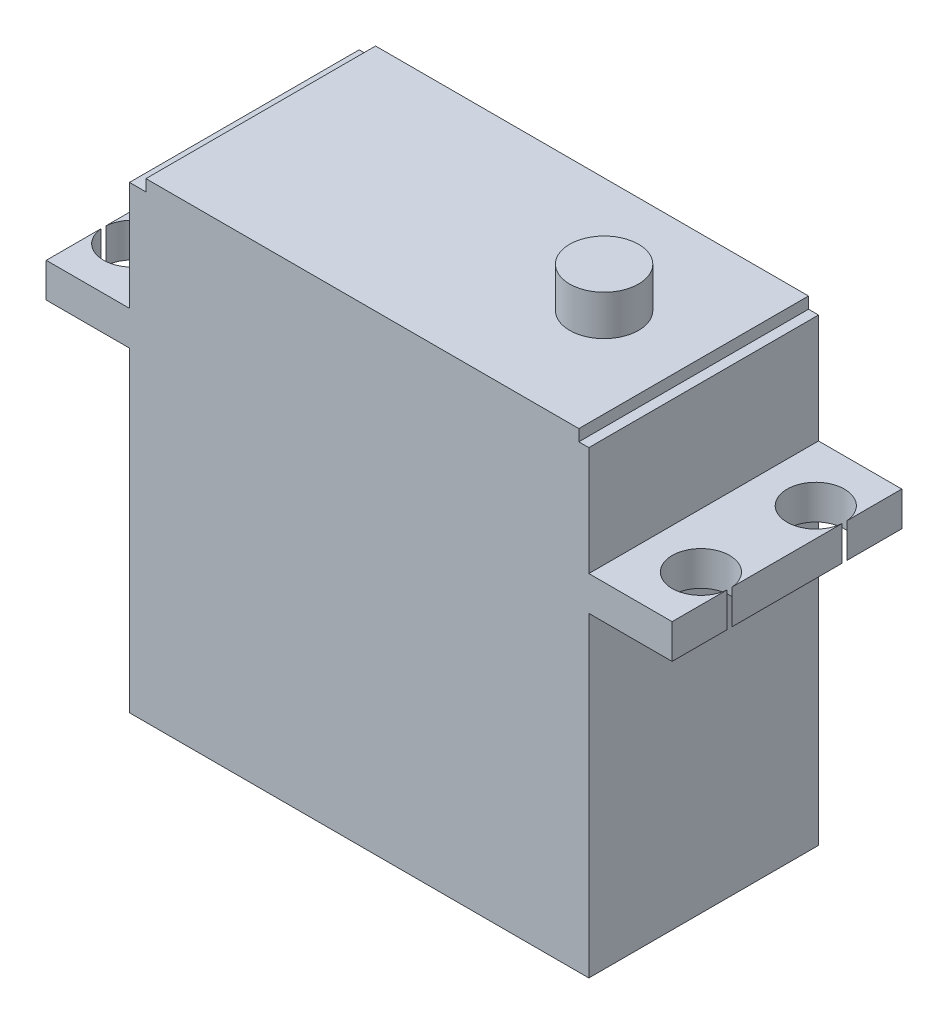
ISO-10303-21;
HEADER;
FILE_DESCRIPTION(('STEP AP214'),'2;1');
FILE_NAME('part.step','',(''),(''),'','','');
FILE_SCHEMA(('AUTOMOTIVE_DESIGN { 1 0 10303 214 1 1 1 1 }'));
ENDSEC;
DATA;
#1=APPLICATION_CONTEXT('core data for automotive mechanical design processes');
#2=APPLICATION_PROTOCOL_DEFINITION('international standard','automotive_design',2000,#1);
#3=PRODUCT_CONTEXT('',#1,'mechanical');
#4=PRODUCT('Part','Part','',(#3));
#5=PRODUCT_RELATED_PRODUCT_CATEGORY('part','',(#4));
#6=PRODUCT_DEFINITION_FORMATION('','',#4);
#7=PRODUCT_DEFINITION_CONTEXT('part definition',#1,'design');
#8=PRODUCT_DEFINITION('design','',#6,#7);
#9=PRODUCT_DEFINITION_SHAPE('','',#8);
#10=(LENGTH_UNIT() NAMED_UNIT(*) SI_UNIT(.MILLI.,.METRE.));
#11=(NAMED_UNIT(*) PLANE_ANGLE_UNIT() SI_UNIT($,.RADIAN.));
#12=(NAMED_UNIT(*) SI_UNIT($,.STERADIAN.) SOLID_ANGLE_UNIT());
#13=UNCERTAINTY_MEASURE_WITH_UNIT(LENGTH_MEASURE(1.E-05),#10,'distance_accuracy_value','');
#14=(GEOMETRIC_REPRESENTATION_CONTEXT(3) GLOBAL_UNCERTAINTY_ASSIGNED_CONTEXT((#13)) GLOBAL_UNIT_ASSIGNED_CONTEXT((#10,
#11,#12)) REPRESENTATION_CONTEXT('',''));
#15=CARTESIAN_POINT('',(0.,0.,0.));
#16=DIRECTION('',(0.,0.,1.));
#17=DIRECTION('',(1.,0.,0.));
#18=AXIS2_PLACEMENT_3D('',#15,#16,#17);
#19=CARTESIAN_POINT('',(-20.,40.,-20.));
#20=DIRECTION('',(0.,1.,0.));
#21=DIRECTION('',(0.,0.,1.));
#22=AXIS2_PLACEMENT_3D('',#19,#20,#21);
#23=PLANE('',#22);
#24=DIRECTION('',(0.,0.,-1.));
#25=VECTOR('',#24,1.);
#26=CARTESIAN_POINT('',(19.1304020421922,40.,0.));
#27=LINE('',#26,#25);
#28=CARTESIAN_POINT('',(19.1304020421922,40.,0.));
#29=VERTEX_POINT('',#28);
#30=CARTESIAN_POINT('',(19.1304020421922,40.,-20.));
#31=VERTEX_POINT('',#30);
#32=EDGE_CURVE('E221',#29,#31,#27,.T.);
#33=ORIENTED_EDGE('',*,*,#32,.F.);
#34=DIRECTION('',(-1.,0.,0.));
#35=VECTOR('',#34,1.);
#36=CARTESIAN_POINT('',(-20.,40.,0.));
#37=LINE('',#36,#35);
#38=CARTESIAN_POINT('',(20.,40.,0.));
#39=VERTEX_POINT('',#38);
#40=EDGE_CURVE('E329',#39,#29,#37,.T.);
#41=ORIENTED_EDGE('',*,*,#40,.F.);
#42=DIRECTION('',(0.,0.,1.));
#43=VECTOR('',#42,1.);
#44=CARTESIAN_POINT('',(20.,40.,-20.));
#45=LINE('',#44,#43);
#46=CARTESIAN_POINT('',(20.,40.,-20.));
#47=VERTEX_POINT('',#46);
#48=EDGE_CURVE('E392',#47,#39,#45,.T.);
#49=ORIENTED_EDGE('',*,*,#48,.F.);
#50=DIRECTION('',(-1.,0.,0.));
#51=VECTOR('',#50,1.);
#52=CARTESIAN_POINT('',(-20.,40.,-20.));
#53=LINE('',#52,#51);
#54=EDGE_CURVE('E63',#47,#31,#53,.T.);
#55=ORIENTED_EDGE('',*,*,#54,.T.);
#56=EDGE_LOOP('',(#33,#41,#49,#55));
#57=FACE_BOUND('',#56,.T.);
#58=ADVANCED_FACE('F39',(#57),#23,.T.);
#59=CARTESIAN_POINT('',(-27.25,27.5,-20.));
#60=DIRECTION('',(-1.,0.,0.));
#61=DIRECTION('',(0.,0.,1.));
#62=AXIS2_PLACEMENT_3D('',#59,#60,#61);
#63=PLANE('',#62);
#64=DIRECTION('',(0.,1.,0.));
#65=VECTOR('',#64,1.);
#66=CARTESIAN_POINT('',(-27.25,10.5,-4.77661692096312));
#67=LINE('',#66,#65);
#68=CARTESIAN_POINT('',(-27.25,27.5,-4.77661692096312));
#69=VERTEX_POINT('',#68);
#70=CARTESIAN_POINT('',(-27.25,30.5,-4.77661692096312));
#71=VERTEX_POINT('',#70);
#72=EDGE_CURVE('E261',#69,#71,#67,.T.);
#73=ORIENTED_EDGE('',*,*,#72,.F.);
#74=DIRECTION('',(0.,0.,1.));
#75=VECTOR('',#74,1.);
#76=CARTESIAN_POINT('',(-27.25,27.5,-20.));
#77=LINE('',#76,#75);
#78=CARTESIAN_POINT('',(-27.25,27.5,0.));
#79=VERTEX_POINT('',#78);
#80=EDGE_CURVE('E378',#69,#79,#77,.T.);
#81=ORIENTED_EDGE('',*,*,#80,.T.);
#82=DIRECTION('',(0.,-1.,0.));
#83=VECTOR('',#82,1.);
#84=CARTESIAN_POINT('',(-27.25,27.5,0.));
#85=LINE('',#84,#83);
#86=CARTESIAN_POINT('',(-27.25,30.5,0.));
#87=VERTEX_POINT('',#86);
#88=EDGE_CURVE('E341',#87,#79,#85,.T.);
#89=ORIENTED_EDGE('',*,*,#88,.F.);
#90=DIRECTION('',(0.,0.,1.));
#91=VECTOR('',#90,1.);
#92=CARTESIAN_POINT('',(-27.25,30.5,-20.));
#93=LINE('',#92,#91);
#94=EDGE_CURVE('E384',#71,#87,#93,.T.);
#95=ORIENTED_EDGE('',*,*,#94,.F.);
#96=EDGE_LOOP('',(#73,#81,#89,#95));
#97=FACE_BOUND('',#96,.T.);
#98=ADVANCED_FACE('F511',(#97),#63,.T.);
#99=DIRECTION('',(0.,1.,0.));
#100=VECTOR('',#99,1.);
#101=CARTESIAN_POINT('',(-27.25,10.5,-5.22338307903688));
#102=LINE('',#101,#100);
#103=CARTESIAN_POINT('',(-27.25,30.5,-5.22338307903688));
#104=VERTEX_POINT('',#103);
#105=CARTESIAN_POINT('',(-27.25,27.5,-5.22338307903688));
#106=VERTEX_POINT('',#105);
#107=EDGE_CURVE('E255',#104,#106,#102,.F.);
#108=ORIENTED_EDGE('',*,*,#107,.F.);
#109=CARTESIAN_POINT('',(-27.25,30.5,-14.7766169209631));
#110=VERTEX_POINT('',#109);
#111=EDGE_CURVE('E383',#110,#104,#93,.T.);
#112=ORIENTED_EDGE('',*,*,#111,.F.);
#113=DIRECTION('',(0.,1.,0.));
#114=VECTOR('',#113,1.);
#115=CARTESIAN_POINT('',(-27.25,10.5,-14.7766169209631));
#116=LINE('',#115,#114);
#117=CARTESIAN_POINT('',(-27.25,27.5,-14.7766169209631));
#118=VERTEX_POINT('',#117);
#119=EDGE_CURVE('E252',#118,#110,#116,.T.);
#120=ORIENTED_EDGE('',*,*,#119,.F.);
#121=EDGE_CURVE('E377',#118,#106,#77,.T.);
#122=ORIENTED_EDGE('',*,*,#121,.T.);
#123=EDGE_LOOP('',(#108,#112,#120,#122));
#124=FACE_BOUND('',#123,.T.);
#125=ADVANCED_FACE('F504',(#124),#63,.T.);
#126=CARTESIAN_POINT('',(27.25,27.5,-20.));
#127=DIRECTION('',(1.,0.,0.));
#128=DIRECTION('',(0.,0.,-1.));
#129=AXIS2_PLACEMENT_3D('',#126,#127,#128);
#130=PLANE('',#129);
#131=DIRECTION('',(0.,1.,0.));
#132=VECTOR('',#131,1.);
#133=CARTESIAN_POINT('',(27.25,10.5,-15.2233830790369));
#134=LINE('',#133,#132);
#135=CARTESIAN_POINT('',(27.25,27.5,-15.2233830790369));
#136=VERTEX_POINT('',#135);
#137=CARTESIAN_POINT('',(27.25,30.5,-15.2233830790369));
#138=VERTEX_POINT('',#137);
#139=EDGE_CURVE('E417',#136,#138,#134,.T.);
#140=ORIENTED_EDGE('',*,*,#139,.F.);
#141=DIRECTION('',(0.,0.,1.));
#142=VECTOR('',#141,1.);
#143=CARTESIAN_POINT('',(27.25,27.5,-20.));
#144=LINE('',#143,#142);
#145=CARTESIAN_POINT('',(27.25,27.5,-20.));
#146=VERTEX_POINT('',#145);
#147=EDGE_CURVE('E404',#146,#136,#144,.T.);
#148=ORIENTED_EDGE('',*,*,#147,.F.);
#149=DIRECTION('',(0.,1.,0.));
#150=VECTOR('',#149,1.);
#151=CARTESIAN_POINT('',(27.25,27.5,-20.));
#152=LINE('',#151,#150);
#153=CARTESIAN_POINT('',(27.25,30.5,-20.));
#154=VERTEX_POINT('',#153);
#155=EDGE_CURVE('E269',#146,#154,#152,.T.);
#156=ORIENTED_EDGE('',*,*,#155,.T.);
#157=DIRECTION('',(0.,0.,1.));
#158=VECTOR('',#157,1.);
#159=CARTESIAN_POINT('',(27.25,30.5,-20.));
#160=LINE('',#159,#158);
#161=EDGE_CURVE('E398',#154,#138,#160,.T.);
#162=ORIENTED_EDGE('',*,*,#161,.T.);
#163=EDGE_LOOP('',(#140,#148,#156,#162));
#164=FACE_BOUND('',#163,.T.);
#165=ADVANCED_FACE('F477',(#164),#130,.T.);
#166=DIRECTION('',(0.,1.,0.));
#167=VECTOR('',#166,1.);
#168=CARTESIAN_POINT('',(27.25,10.5,-14.7766169209631));
#169=LINE('',#168,#167);
#170=CARTESIAN_POINT('',(27.25,30.5,-14.7766169209631));
#171=VERTEX_POINT('',#170);
#172=CARTESIAN_POINT('',(27.25,27.5,-14.7766169209631));
#173=VERTEX_POINT('',#172);
#174=EDGE_CURVE('E414',#171,#173,#169,.F.);
#175=ORIENTED_EDGE('',*,*,#174,.F.);
#176=CARTESIAN_POINT('',(27.25,30.5,-5.22338307903696));
#177=VERTEX_POINT('',#176);
#178=EDGE_CURVE('E402',#171,#177,#160,.T.);
#179=ORIENTED_EDGE('',*,*,#178,.T.);
#180=DIRECTION('',(0.,1.,0.));
#181=VECTOR('',#180,1.);
#182=CARTESIAN_POINT('',(27.25,10.5,-5.22338307903696));
#183=LINE('',#182,#181);
#184=CARTESIAN_POINT('',(27.25,27.5,-5.22338307903696));
#185=VERTEX_POINT('',#184);
#186=EDGE_CURVE('E411',#185,#177,#183,.T.);
#187=ORIENTED_EDGE('',*,*,#186,.F.);
#188=EDGE_CURVE('E408',#173,#185,#144,.T.);
#189=ORIENTED_EDGE('',*,*,#188,.F.);
#190=EDGE_LOOP('',(#175,#179,#187,#189));
#191=FACE_BOUND('',#190,.T.);
#192=ADVANCED_FACE('F527',(#191),#130,.T.);
#193=CARTESIAN_POINT('',(20.,27.5,-20.));
#194=DIRECTION('',(0.,-1.,0.));
#195=DIRECTION('',(1.,0.,0.));
#196=AXIS2_PLACEMENT_3D('',#193,#194,#195);
#197=PLANE('',#196);
#198=CARTESIAN_POINT('',(24.76,27.5,-15.));
#199=DIRECTION('',(0.,-1.,0.));
#200=DIRECTION('',(1.,0.,0.));
#201=AXIS2_PLACEMENT_3D('',#198,#199,#200);
#202=CIRCLE('',#201,2.5);
#203=EDGE_CURVE('E243',#173,#136,#202,.T.);
#204=ORIENTED_EDGE('',*,*,#203,.F.);
#205=ORIENTED_EDGE('',*,*,#188,.T.);
#206=CARTESIAN_POINT('',(24.76,27.5,-5.00000000000001));
#207=DIRECTION('',(0.,-1.,0.));
#208=DIRECTION('',(1.,0.,0.));
#209=AXIS2_PLACEMENT_3D('',#206,#207,#208);
#210=CIRCLE('',#209,2.5);
#211=CARTESIAN_POINT('',(27.25,27.5,-4.77661692096305));
#212=VERTEX_POINT('',#211);
#213=EDGE_CURVE('E239',#212,#185,#210,.T.);
#214=ORIENTED_EDGE('',*,*,#213,.F.);
#215=CARTESIAN_POINT('',(27.25,27.5,0.));
#216=VERTEX_POINT('',#215);
#217=EDGE_CURVE('E312',#212,#216,#144,.T.);
#218=ORIENTED_EDGE('',*,*,#217,.T.);
#219=DIRECTION('',(1.,0.,0.));
#220=VECTOR('',#219,1.);
#221=CARTESIAN_POINT('',(20.,27.5,0.));
#222=LINE('',#221,#220);
#223=CARTESIAN_POINT('',(20.,27.5,0.));
#224=VERTEX_POINT('',#223);
#225=EDGE_CURVE('E264',#224,#216,#222,.T.);
#226=ORIENTED_EDGE('',*,*,#225,.F.);
#227=DIRECTION('',(0.,0.,1.));
#228=VECTOR('',#227,1.);
#229=CARTESIAN_POINT('',(20.,27.5,-20.));
#230=LINE('',#229,#228);
#231=CARTESIAN_POINT('',(20.,27.5,-20.));
#232=VERTEX_POINT('',#231);
#233=EDGE_CURVE('E360',#232,#224,#230,.T.);
#234=ORIENTED_EDGE('',*,*,#233,.F.);
#235=DIRECTION('',(1.,0.,0.));
#236=VECTOR('',#235,1.);
#237=CARTESIAN_POINT('',(20.,27.5,-20.));
#238=LINE('',#237,#236);
#239=EDGE_CURVE('E265',#232,#146,#238,.T.);
#240=ORIENTED_EDGE('',*,*,#239,.T.);
#241=ORIENTED_EDGE('',*,*,#147,.T.);
#242=EDGE_LOOP('',(#204,#205,#214,#218,#226,#234,#240,#241));
#243=FACE_BOUND('',#242,.T.);
#244=ADVANCED_FACE('F41',(#243),#197,.T.);
#245=CARTESIAN_POINT('',(20.,0.,-20.));
#246=DIRECTION('',(1.,0.,0.));
#247=DIRECTION('',(0.,0.,-1.));
#248=AXIS2_PLACEMENT_3D('',#245,#246,#247);
#249=PLANE('',#248);
#250=DIRECTION('',(0.,1.,0.));
#251=VECTOR('',#250,1.);
#252=CARTESIAN_POINT('',(20.,0.,0.));
#253=LINE('',#252,#251);
#254=CARTESIAN_POINT('',(20.,0.,0.));
#255=VERTEX_POINT('',#254);
#256=EDGE_CURVE('E270',#255,#224,#253,.T.);
#257=ORIENTED_EDGE('',*,*,#256,.F.);
#258=DIRECTION('',(0.,0.,1.));
#259=VECTOR('',#258,1.);
#260=CARTESIAN_POINT('',(20.,0.,-20.));
#261=LINE('',#260,#259);
#262=CARTESIAN_POINT('',(20.,0.,-20.));
#263=VERTEX_POINT('',#262);
#264=EDGE_CURVE('E364',#263,#255,#261,.T.);
#265=ORIENTED_EDGE('',*,*,#264,.F.);
#266=DIRECTION('',(0.,1.,0.));
#267=VECTOR('',#266,1.);
#268=CARTESIAN_POINT('',(20.,0.,-20.));
#269=LINE('',#268,#267);
#270=EDGE_CURVE('E308',#263,#232,#269,.T.);
#271=ORIENTED_EDGE('',*,*,#270,.T.);
#272=ORIENTED_EDGE('',*,*,#233,.T.);
#273=EDGE_LOOP('',(#257,#265,#271,#272));
#274=FACE_BOUND('',#273,.T.);
#275=ADVANCED_FACE('F487',(#274),#249,.T.);
#276=CARTESIAN_POINT('',(20.,0.,-20.));
#277=DIRECTION('',(0.,-1.,0.));
#278=DIRECTION('',(0.,0.,-1.));
#279=AXIS2_PLACEMENT_3D('',#276,#277,#278);
#280=PLANE('',#279);
#281=DIRECTION('',(1.,0.,0.));
#282=VECTOR('',#281,1.);
#283=CARTESIAN_POINT('',(20.,0.,0.));
#284=LINE('',#283,#282);
#285=CARTESIAN_POINT('',(-20.,0.,0.));
#286=VERTEX_POINT('',#285);
#287=EDGE_CURVE('E353',#286,#255,#284,.T.);
#288=ORIENTED_EDGE('',*,*,#287,.F.);
#289=DIRECTION('',(0.,0.,1.));
#290=VECTOR('',#289,1.);
#291=CARTESIAN_POINT('',(-20.,0.,-20.));
#292=LINE('',#291,#290);
#293=CARTESIAN_POINT('',(-20.,0.,-20.));
#294=VERTEX_POINT('',#293);
#295=EDGE_CURVE('E367',#294,#286,#292,.T.);
#296=ORIENTED_EDGE('',*,*,#295,.F.);
#297=DIRECTION('',(1.,0.,0.));
#298=VECTOR('',#297,1.);
#299=CARTESIAN_POINT('',(20.,0.,-20.));
#300=LINE('',#299,#298);
#301=EDGE_CURVE('E304',#294,#263,#300,.T.);
#302=ORIENTED_EDGE('',*,*,#301,.T.);
#303=ORIENTED_EDGE('',*,*,#264,.T.);
#304=EDGE_LOOP('',(#288,#296,#302,#303));
#305=FACE_BOUND('',#304,.T.);
#306=ADVANCED_FACE('F490',(#305),#280,.T.);
#307=CARTESIAN_POINT('',(-20.,0.,-20.));
#308=DIRECTION('',(-1.,0.,0.));
#309=DIRECTION('',(0.,0.,1.));
#310=AXIS2_PLACEMENT_3D('',#307,#308,#309);
#311=PLANE('',#310);
#312=DIRECTION('',(0.,-1.,0.));
#313=VECTOR('',#312,1.);
#314=CARTESIAN_POINT('',(-20.,0.,0.));
#315=LINE('',#314,#313);
#316=CARTESIAN_POINT('',(-20.,27.5,0.));
#317=VERTEX_POINT('',#316);
#318=EDGE_CURVE('E349',#317,#286,#315,.T.);
#319=ORIENTED_EDGE('',*,*,#318,.F.);
#320=DIRECTION('',(0.,0.,1.));
#321=VECTOR('',#320,1.);
#322=CARTESIAN_POINT('',(-20.,27.5,-20.));
#323=LINE('',#322,#321);
#324=CARTESIAN_POINT('',(-20.,27.5,-20.));
#325=VERTEX_POINT('',#324);
#326=EDGE_CURVE('E370',#325,#317,#323,.T.);
#327=ORIENTED_EDGE('',*,*,#326,.F.);
#328=DIRECTION('',(0.,-1.,0.));
#329=VECTOR('',#328,1.);
#330=CARTESIAN_POINT('',(-20.,0.,-20.));
#331=LINE('',#330,#329);
#332=EDGE_CURVE('E300',#325,#294,#331,.T.);
#333=ORIENTED_EDGE('',*,*,#332,.T.);
#334=ORIENTED_EDGE('',*,*,#295,.T.);
#335=EDGE_LOOP('',(#319,#327,#333,#334));
#336=FACE_BOUND('',#335,.T.);
#337=ADVANCED_FACE('F494',(#336),#311,.T.);
#338=CARTESIAN_POINT('',(-20.,27.5,-20.));
#339=DIRECTION('',(0.,-1.,0.));
#340=DIRECTION('',(1.,0.,0.));
#341=AXIS2_PLACEMENT_3D('',#338,#339,#340);
#342=PLANE('',#341);
#343=CARTESIAN_POINT('',(-24.76,27.5,-5.));
#344=DIRECTION('',(0.,-1.,0.));
#345=DIRECTION('',(1.,0.,0.));
#346=AXIS2_PLACEMENT_3D('',#343,#344,#345);
#347=CIRCLE('',#346,2.5);
#348=EDGE_CURVE('E258',#106,#69,#347,.T.);
#349=ORIENTED_EDGE('',*,*,#348,.F.);
#350=ORIENTED_EDGE('',*,*,#121,.F.);
#351=CARTESIAN_POINT('',(-24.76,27.5,-15.));
#352=DIRECTION('',(0.,-1.,0.));
#353=DIRECTION('',(1.,0.,0.));
#354=AXIS2_PLACEMENT_3D('',#351,#352,#353);
#355=CIRCLE('',#354,2.5);
#356=CARTESIAN_POINT('',(-27.25,27.5,-15.2233830790369));
#357=VERTEX_POINT('',#356);
#358=EDGE_CURVE('E249',#357,#118,#355,.T.);
#359=ORIENTED_EDGE('',*,*,#358,.F.);
#360=CARTESIAN_POINT('',(-27.25,27.5,-20.));
#361=VERTEX_POINT('',#360);
#362=EDGE_CURVE('E373',#361,#357,#77,.T.);
#363=ORIENTED_EDGE('',*,*,#362,.F.);
#364=DIRECTION('',(1.,0.,0.));
#365=VECTOR('',#364,1.);
#366=CARTESIAN_POINT('',(-20.,27.5,-20.));
#367=LINE('',#366,#365);
#368=EDGE_CURVE('E296',#361,#325,#367,.T.);
#369=ORIENTED_EDGE('',*,*,#368,.T.);
#370=ORIENTED_EDGE('',*,*,#326,.T.);
#371=DIRECTION('',(1.,0.,0.));
#372=VECTOR('',#371,1.);
#373=CARTESIAN_POINT('',(-20.,27.5,0.));
#374=LINE('',#373,#372);
#375=EDGE_CURVE('E345',#79,#317,#374,.T.);
#376=ORIENTED_EDGE('',*,*,#375,.F.);
#377=ORIENTED_EDGE('',*,*,#80,.F.);
#378=EDGE_LOOP('',(#349,#350,#359,#363,#369,#370,#376,#377));
#379=FACE_BOUND('',#378,.T.);
#380=ADVANCED_FACE('F498',(#379),#342,.T.);
#381=DIRECTION('',(0.,1.,0.));
#382=VECTOR('',#381,1.);
#383=CARTESIAN_POINT('',(-27.25,10.5,-15.2233830790369));
#384=LINE('',#383,#382);
#385=CARTESIAN_POINT('',(-27.25,30.5,-15.2233830790369));
#386=VERTEX_POINT('',#385);
#387=EDGE_CURVE('E246',#386,#357,#384,.F.);
#388=ORIENTED_EDGE('',*,*,#387,.F.);
#389=CARTESIAN_POINT('',(-27.25,30.5,-20.));
#390=VERTEX_POINT('',#389);
#391=EDGE_CURVE('E379',#390,#386,#93,.T.);
#392=ORIENTED_EDGE('',*,*,#391,.F.);
#393=DIRECTION('',(0.,-1.,0.));
#394=VECTOR('',#393,1.);
#395=CARTESIAN_POINT('',(-27.25,27.5,-20.));
#396=LINE('',#395,#394);
#397=EDGE_CURVE('E292',#390,#361,#396,.T.);
#398=ORIENTED_EDGE('',*,*,#397,.T.);
#399=ORIENTED_EDGE('',*,*,#362,.T.);
#400=EDGE_LOOP('',(#388,#392,#398,#399));
#401=FACE_BOUND('',#400,.T.);
#402=ADVANCED_FACE('F430',(#401),#63,.T.);
#403=CARTESIAN_POINT('',(-27.25,30.5,-20.));
#404=DIRECTION('',(0.,1.,0.));
#405=DIRECTION('',(0.,0.,1.));
#406=AXIS2_PLACEMENT_3D('',#403,#404,#405);
#407=PLANE('',#406);
#408=CARTESIAN_POINT('',(-24.76,30.5,-5.));
#409=DIRECTION('',(0.,1.,0.));
#410=DIRECTION('',(0.,0.,1.));
#411=AXIS2_PLACEMENT_3D('',#408,#409,#410);
#412=CIRCLE('',#411,2.5);
#413=EDGE_CURVE('E11',#71,#104,#412,.T.);
#414=ORIENTED_EDGE('',*,*,#413,.F.);
#415=ORIENTED_EDGE('',*,*,#94,.T.);
#416=DIRECTION('',(-1.,0.,0.));
#417=VECTOR('',#416,1.);
#418=CARTESIAN_POINT('',(-27.25,30.5,0.));
#419=LINE('',#418,#417);
#420=CARTESIAN_POINT('',(-20.,30.5,0.));
#421=VERTEX_POINT('',#420);
#422=EDGE_CURVE('E337',#421,#87,#419,.T.);
#423=ORIENTED_EDGE('',*,*,#422,.F.);
#424=DIRECTION('',(0.,0.,1.));
#425=VECTOR('',#424,1.);
#426=CARTESIAN_POINT('',(-20.,30.5,-20.));
#427=LINE('',#426,#425);
#428=CARTESIAN_POINT('',(-20.,30.5,-20.));
#429=VERTEX_POINT('',#428);
#430=EDGE_CURVE('E385',#429,#421,#427,.T.);
#431=ORIENTED_EDGE('',*,*,#430,.F.);
#432=DIRECTION('',(-1.,0.,0.));
#433=VECTOR('',#432,1.);
#434=CARTESIAN_POINT('',(-27.25,30.5,-20.));
#435=LINE('',#434,#433);
#436=EDGE_CURVE('E288',#429,#390,#435,.T.);
#437=ORIENTED_EDGE('',*,*,#436,.T.);
#438=ORIENTED_EDGE('',*,*,#391,.T.);
#439=CARTESIAN_POINT('',(-24.76,30.5,-15.));
#440=DIRECTION('',(0.,1.,0.));
#441=DIRECTION('',(0.,0.,1.));
#442=AXIS2_PLACEMENT_3D('',#439,#440,#441);
#443=CIRCLE('',#442,2.5);
#444=EDGE_CURVE('E48',#110,#386,#443,.T.);
#445=ORIENTED_EDGE('',*,*,#444,.F.);
#446=ORIENTED_EDGE('',*,*,#111,.T.);
#447=EDGE_LOOP('',(#414,#415,#423,#431,#437,#438,#445,#446));
#448=FACE_BOUND('',#447,.T.);
#449=ADVANCED_FACE('F433',(#448),#407,.T.);
#450=CARTESIAN_POINT('',(-20.,30.5,-20.));
#451=DIRECTION('',(-1.,0.,0.));
#452=DIRECTION('',(0.,0.,1.));
#453=AXIS2_PLACEMENT_3D('',#450,#451,#452);
#454=PLANE('',#453);
#455=DIRECTION('',(0.,-1.,0.));
#456=VECTOR('',#455,1.);
#457=CARTESIAN_POINT('',(-20.,30.5,0.));
#458=LINE('',#457,#456);
#459=CARTESIAN_POINT('',(-20.,40.,0.));
#460=VERTEX_POINT('',#459);
#461=EDGE_CURVE('E333',#460,#421,#458,.T.);
#462=ORIENTED_EDGE('',*,*,#461,.F.);
#463=DIRECTION('',(0.,0.,1.));
#464=VECTOR('',#463,1.);
#465=CARTESIAN_POINT('',(-20.,40.,-20.));
#466=LINE('',#465,#464);
#467=CARTESIAN_POINT('',(-20.,40.,-20.));
#468=VERTEX_POINT('',#467);
#469=EDGE_CURVE('E388',#468,#460,#466,.T.);
#470=ORIENTED_EDGE('',*,*,#469,.F.);
#471=DIRECTION('',(0.,-1.,0.));
#472=VECTOR('',#471,1.);
#473=CARTESIAN_POINT('',(-20.,30.5,-20.));
#474=LINE('',#473,#472);
#475=EDGE_CURVE('E284',#468,#429,#474,.T.);
#476=ORIENTED_EDGE('',*,*,#475,.T.);
#477=ORIENTED_EDGE('',*,*,#430,.T.);
#478=EDGE_LOOP('',(#462,#470,#476,#477));
#479=FACE_BOUND('',#478,.T.);
#480=ADVANCED_FACE('F440',(#479),#454,.T.);
#481=DIRECTION('',(0.,0.,1.));
#482=VECTOR('',#481,1.);
#483=CARTESIAN_POINT('',(-18.5702145738996,40.,-20.));
#484=LINE('',#483,#482);
#485=CARTESIAN_POINT('',(-18.5702145738996,40.,-20.));
#486=VERTEX_POINT('',#485);
#487=CARTESIAN_POINT('',(-18.5702145738996,40.,0.));
#488=VERTEX_POINT('',#487);
#489=EDGE_CURVE('E55',#486,#488,#484,.T.);
#490=ORIENTED_EDGE('',*,*,#489,.F.);
#491=EDGE_CURVE('E226',#486,#468,#53,.T.);
#492=ORIENTED_EDGE('',*,*,#491,.T.);
#493=ORIENTED_EDGE('',*,*,#469,.T.);
#494=EDGE_CURVE('E328',#488,#460,#37,.T.);
#495=ORIENTED_EDGE('',*,*,#494,.F.);
#496=EDGE_LOOP('',(#490,#492,#493,#495));
#497=FACE_BOUND('',#496,.T.);
#498=ADVANCED_FACE('F441',(#497),#23,.T.);
#499=CARTESIAN_POINT('',(20.,30.5,-20.));
#500=DIRECTION('',(1.,0.,0.));
#501=DIRECTION('',(0.,0.,-1.));
#502=AXIS2_PLACEMENT_3D('',#499,#500,#501);
#503=PLANE('',#502);
#504=DIRECTION('',(0.,1.,0.));
#505=VECTOR('',#504,1.);
#506=CARTESIAN_POINT('',(20.,30.5,0.));
#507=LINE('',#506,#505);
#508=CARTESIAN_POINT('',(20.,30.5,0.));
#509=VERTEX_POINT('',#508);
#510=EDGE_CURVE('E324',#509,#39,#507,.T.);
#511=ORIENTED_EDGE('',*,*,#510,.F.);
#512=DIRECTION('',(0.,0.,1.));
#513=VECTOR('',#512,1.);
#514=CARTESIAN_POINT('',(20.,30.5,-20.));
#515=LINE('',#514,#513);
#516=CARTESIAN_POINT('',(20.,30.5,-20.));
#517=VERTEX_POINT('',#516);
#518=EDGE_CURVE('E395',#517,#509,#515,.T.);
#519=ORIENTED_EDGE('',*,*,#518,.F.);
#520=DIRECTION('',(0.,1.,0.));
#521=VECTOR('',#520,1.);
#522=CARTESIAN_POINT('',(20.,30.5,-20.));
#523=LINE('',#522,#521);
#524=EDGE_CURVE('E278',#517,#47,#523,.T.);
#525=ORIENTED_EDGE('',*,*,#524,.T.);
#526=ORIENTED_EDGE('',*,*,#48,.T.);
#527=EDGE_LOOP('',(#511,#519,#525,#526));
#528=FACE_BOUND('',#527,.T.);
#529=ADVANCED_FACE('F467',(#528),#503,.T.);
#530=CARTESIAN_POINT('',(27.25,30.5,-20.));
#531=DIRECTION('',(0.,1.,0.));
#532=DIRECTION('',(0.,0.,1.));
#533=AXIS2_PLACEMENT_3D('',#530,#531,#532);
#534=PLANE('',#533);
#535=CARTESIAN_POINT('',(24.76,30.5,-15.));
#536=DIRECTION('',(0.,1.,0.));
#537=DIRECTION('',(0.,0.,-1.));
#538=AXIS2_PLACEMENT_3D('',#535,#536,#537);
#539=CIRCLE('',#538,2.5);
#540=EDGE_CURVE('E228',#138,#171,#539,.T.);
#541=ORIENTED_EDGE('',*,*,#540,.F.);
#542=ORIENTED_EDGE('',*,*,#161,.F.);
#543=DIRECTION('',(-1.,0.,0.));
#544=VECTOR('',#543,1.);
#545=CARTESIAN_POINT('',(27.25,30.5,-20.));
#546=LINE('',#545,#544);
#547=EDGE_CURVE('E274',#154,#517,#546,.T.);
#548=ORIENTED_EDGE('',*,*,#547,.T.);
#549=ORIENTED_EDGE('',*,*,#518,.T.);
#550=DIRECTION('',(-1.,0.,0.));
#551=VECTOR('',#550,1.);
#552=CARTESIAN_POINT('',(27.25,30.5,0.));
#553=LINE('',#552,#551);
#554=CARTESIAN_POINT('',(27.25,30.5,0.));
#555=VERTEX_POINT('',#554);
#556=EDGE_CURVE('E320',#555,#509,#553,.T.);
#557=ORIENTED_EDGE('',*,*,#556,.F.);
#558=CARTESIAN_POINT('',(27.25,30.5,-4.77661692096305));
#559=VERTEX_POINT('',#558);
#560=EDGE_CURVE('E403',#559,#555,#160,.T.);
#561=ORIENTED_EDGE('',*,*,#560,.F.);
#562=CARTESIAN_POINT('',(24.76,30.5,-5.00000000000001));
#563=DIRECTION('',(0.,1.,0.));
#564=DIRECTION('',(0.,0.,1.));
#565=AXIS2_PLACEMENT_3D('',#562,#563,#564);
#566=CIRCLE('',#565,2.5);
#567=EDGE_CURVE('E232',#177,#559,#566,.T.);
#568=ORIENTED_EDGE('',*,*,#567,.F.);
#569=ORIENTED_EDGE('',*,*,#178,.F.);
#570=EDGE_LOOP('',(#541,#542,#548,#549,#557,#561,#568,#569));
#571=FACE_BOUND('',#570,.T.);
#572=ADVANCED_FACE('F472',(#571),#534,.T.);
#573=DIRECTION('',(0.,1.,0.));
#574=VECTOR('',#573,1.);
#575=CARTESIAN_POINT('',(27.25,10.5,-4.77661692096305));
#576=LINE('',#575,#574);
#577=EDGE_CURVE('E363',#559,#212,#576,.F.);
#578=ORIENTED_EDGE('',*,*,#577,.F.);
#579=ORIENTED_EDGE('',*,*,#560,.T.);
#580=DIRECTION('',(0.,1.,0.));
#581=VECTOR('',#580,1.);
#582=CARTESIAN_POINT('',(27.25,27.5,0.));
#583=LINE('',#582,#581);
#584=EDGE_CURVE('E316',#216,#555,#583,.T.);
#585=ORIENTED_EDGE('',*,*,#584,.F.);
#586=ORIENTED_EDGE('',*,*,#217,.F.);
#587=EDGE_LOOP('',(#578,#579,#585,#586));
#588=FACE_BOUND('',#587,.T.);
#589=ADVANCED_FACE('F518',(#588),#130,.T.);
#590=CARTESIAN_POINT('',(0.,0.,-20.));
#591=DIRECTION('',(0.,0.,1.));
#592=DIRECTION('',(1.,0.,0.));
#593=AXIS2_PLACEMENT_3D('',#590,#591,#592);
#594=PLANE('',#593);
#595=ORIENTED_EDGE('',*,*,#239,.F.);
#596=ORIENTED_EDGE('',*,*,#270,.F.);
#597=ORIENTED_EDGE('',*,*,#301,.F.);
#598=ORIENTED_EDGE('',*,*,#332,.F.);
#599=ORIENTED_EDGE('',*,*,#368,.F.);
#600=ORIENTED_EDGE('',*,*,#397,.F.);
#601=ORIENTED_EDGE('',*,*,#436,.F.);
#602=ORIENTED_EDGE('',*,*,#475,.F.);
#603=ORIENTED_EDGE('',*,*,#491,.F.);
#604=DIRECTION('',(0.,-1.,0.));
#605=VECTOR('',#604,1.);
#606=CARTESIAN_POINT('',(-18.5702145738996,41.,-20.));
#607=LINE('',#606,#605);
#608=CARTESIAN_POINT('',(-18.5702145738996,41.,-20.));
#609=VERTEX_POINT('',#608);
#610=EDGE_CURVE('E204',#609,#486,#607,.T.);
#611=ORIENTED_EDGE('',*,*,#610,.F.);
#612=DIRECTION('',(-1.,0.,0.));
#613=VECTOR('',#612,1.);
#614=CARTESIAN_POINT('',(19.1304020421922,41.,-20.));
#615=LINE('',#614,#613);
#616=CARTESIAN_POINT('',(19.1304020421922,41.,-20.));
#617=VERTEX_POINT('',#616);
#618=EDGE_CURVE('E211',#617,#609,#615,.T.);
#619=ORIENTED_EDGE('',*,*,#618,.F.);
#620=DIRECTION('',(0.,-1.,0.));
#621=VECTOR('',#620,1.);
#622=CARTESIAN_POINT('',(19.1304020421922,41.,-20.));
#623=LINE('',#622,#621);
#624=EDGE_CURVE('E451',#617,#31,#623,.T.);
#625=ORIENTED_EDGE('',*,*,#624,.T.);
#626=ORIENTED_EDGE('',*,*,#54,.F.);
#627=ORIENTED_EDGE('',*,*,#524,.F.);
#628=ORIENTED_EDGE('',*,*,#547,.F.);
#629=ORIENTED_EDGE('',*,*,#155,.F.);
#630=EDGE_LOOP('',(#595,#596,#597,#598,#599,#600,#601,#602,#603,#611,#619,#625,#626,#627,#628,#629));
#631=FACE_BOUND('',#630,.T.);
#632=ADVANCED_FACE('F224',(#631),#594,.F.);
#633=CARTESIAN_POINT('',(0.,0.,0.));
#634=DIRECTION('',(0.,0.,1.));
#635=DIRECTION('',(1.,0.,0.));
#636=AXIS2_PLACEMENT_3D('',#633,#634,#635);
#637=PLANE('',#636);
#638=ORIENTED_EDGE('',*,*,#225,.T.);
#639=ORIENTED_EDGE('',*,*,#584,.T.);
#640=ORIENTED_EDGE('',*,*,#556,.T.);
#641=ORIENTED_EDGE('',*,*,#510,.T.);
#642=ORIENTED_EDGE('',*,*,#40,.T.);
#643=DIRECTION('',(0.,-1.,0.));
#644=VECTOR('',#643,1.);
#645=CARTESIAN_POINT('',(19.1304020421922,41.,0.));
#646=LINE('',#645,#644);
#647=CARTESIAN_POINT('',(19.1304020421922,41.,0.));
#648=VERTEX_POINT('',#647);
#649=EDGE_CURVE('E234',#648,#29,#646,.T.);
#650=ORIENTED_EDGE('',*,*,#649,.F.);
#651=DIRECTION('',(1.,0.,0.));
#652=VECTOR('',#651,1.);
#653=CARTESIAN_POINT('',(-18.5702145738996,41.,0.));
#654=LINE('',#653,#652);
#655=CARTESIAN_POINT('',(-18.5702145738996,41.,0.));
#656=VERTEX_POINT('',#655);
#657=EDGE_CURVE('E210',#656,#648,#654,.T.);
#658=ORIENTED_EDGE('',*,*,#657,.F.);
#659=DIRECTION('',(0.,-1.,0.));
#660=VECTOR('',#659,1.);
#661=CARTESIAN_POINT('',(-18.5702145738996,41.,0.));
#662=LINE('',#661,#660);
#663=EDGE_CURVE('E206',#656,#488,#662,.T.);
#664=ORIENTED_EDGE('',*,*,#663,.T.);
#665=ORIENTED_EDGE('',*,*,#494,.T.);
#666=ORIENTED_EDGE('',*,*,#461,.T.);
#667=ORIENTED_EDGE('',*,*,#422,.T.);
#668=ORIENTED_EDGE('',*,*,#88,.T.);
#669=ORIENTED_EDGE('',*,*,#375,.T.);
#670=ORIENTED_EDGE('',*,*,#318,.T.);
#671=ORIENTED_EDGE('',*,*,#287,.T.);
#672=ORIENTED_EDGE('',*,*,#256,.T.);
#673=EDGE_LOOP('',(#638,#639,#640,#641,#642,#650,#658,#664,#665,#666,#667,#668,#669,#670,#671,#672));
#674=FACE_BOUND('',#673,.T.);
#675=ADVANCED_FACE('F445',(#674),#637,.T.);
#676=CARTESIAN_POINT('',(24.76,10.5,-5.00000000000001));
#677=DIRECTION('',(0.,1.,0.));
#678=DIRECTION('',(0.,0.,1.));
#679=AXIS2_PLACEMENT_3D('',#676,#677,#678);
#680=CYLINDRICAL_SURFACE('',#679,2.5);
#681=ORIENTED_EDGE('',*,*,#186,.T.);
#682=ORIENTED_EDGE('',*,*,#567,.T.);
#683=ORIENTED_EDGE('',*,*,#577,.T.);
#684=ORIENTED_EDGE('',*,*,#213,.T.);
#685=EDGE_LOOP('',(#681,#682,#683,#684));
#686=FACE_BOUND('',#685,.T.);
#687=ADVANCED_FACE('F529',(#686),#680,.F.);
#688=CARTESIAN_POINT('',(24.76,10.5,-15.));
#689=DIRECTION('',(0.,1.,0.));
#690=DIRECTION('',(0.,0.,1.));
#691=AXIS2_PLACEMENT_3D('',#688,#689,#690);
#692=CYLINDRICAL_SURFACE('',#691,2.5);
#693=ORIENTED_EDGE('',*,*,#139,.T.);
#694=ORIENTED_EDGE('',*,*,#540,.T.);
#695=ORIENTED_EDGE('',*,*,#174,.T.);
#696=ORIENTED_EDGE('',*,*,#203,.T.);
#697=EDGE_LOOP('',(#693,#694,#695,#696));
#698=FACE_BOUND('',#697,.T.);
#699=ADVANCED_FACE('F531',(#698),#692,.F.);
#700=CARTESIAN_POINT('',(-24.76,10.5,-15.));
#701=DIRECTION('',(0.,1.,0.));
#702=DIRECTION('',(0.,0.,1.));
#703=AXIS2_PLACEMENT_3D('',#700,#701,#702);
#704=CYLINDRICAL_SURFACE('',#703,2.5);
#705=ORIENTED_EDGE('',*,*,#119,.T.);
#706=ORIENTED_EDGE('',*,*,#444,.T.);
#707=ORIENTED_EDGE('',*,*,#387,.T.);
#708=ORIENTED_EDGE('',*,*,#358,.T.);
#709=EDGE_LOOP('',(#705,#706,#707,#708));
#710=FACE_BOUND('',#709,.T.);
#711=ADVANCED_FACE('F423',(#710),#704,.F.);
#712=CARTESIAN_POINT('',(-24.76,10.5,-5.));
#713=DIRECTION('',(0.,1.,0.));
#714=DIRECTION('',(0.,0.,1.));
#715=AXIS2_PLACEMENT_3D('',#712,#713,#714);
#716=CYLINDRICAL_SURFACE('',#715,2.5);
#717=ORIENTED_EDGE('',*,*,#72,.T.);
#718=ORIENTED_EDGE('',*,*,#413,.T.);
#719=ORIENTED_EDGE('',*,*,#107,.T.);
#720=ORIENTED_EDGE('',*,*,#348,.T.);
#721=EDGE_LOOP('',(#717,#718,#719,#720));
#722=FACE_BOUND('',#721,.T.);
#723=ADVANCED_FACE('F571',(#722),#716,.F.);
#724=CARTESIAN_POINT('',(-18.5702145738996,41.,-20.));
#725=DIRECTION('',(1.,0.,0.));
#726=DIRECTION('',(0.,0.,-1.));
#727=AXIS2_PLACEMENT_3D('',#724,#725,#726);
#728=PLANE('',#727);
#729=ORIENTED_EDGE('',*,*,#489,.T.);
#730=ORIENTED_EDGE('',*,*,#663,.F.);
#731=DIRECTION('',(0.,0.,1.));
#732=VECTOR('',#731,1.);
#733=CARTESIAN_POINT('',(-18.5702145738996,41.,-20.));
#734=LINE('',#733,#732);
#735=EDGE_CURVE('E200',#609,#656,#734,.T.);
#736=ORIENTED_EDGE('',*,*,#735,.F.);
#737=ORIENTED_EDGE('',*,*,#610,.T.);
#738=EDGE_LOOP('',(#729,#730,#736,#737));
#739=FACE_BOUND('',#738,.T.);
#740=ADVANCED_FACE('F202',(#739),#728,.F.);
#741=CARTESIAN_POINT('',(19.1304020421922,41.,0.));
#742=DIRECTION('',(-1.,0.,0.));
#743=DIRECTION('',(0.,0.,1.));
#744=AXIS2_PLACEMENT_3D('',#741,#742,#743);
#745=PLANE('',#744);
#746=ORIENTED_EDGE('',*,*,#32,.T.);
#747=ORIENTED_EDGE('',*,*,#624,.F.);
#748=DIRECTION('',(0.,0.,-1.));
#749=VECTOR('',#748,1.);
#750=CARTESIAN_POINT('',(19.1304020421922,41.,0.));
#751=LINE('',#750,#749);
#752=EDGE_CURVE('E216',#648,#617,#751,.T.);
#753=ORIENTED_EDGE('',*,*,#752,.F.);
#754=ORIENTED_EDGE('',*,*,#649,.T.);
#755=EDGE_LOOP('',(#746,#747,#753,#754));
#756=FACE_BOUND('',#755,.T.);
#757=ADVANCED_FACE('F462',(#756),#745,.F.);
#758=CARTESIAN_POINT('',(0.,41.,0.));
#759=DIRECTION('',(0.,1.,0.));
#760=DIRECTION('',(0.,0.,1.));
#761=AXIS2_PLACEMENT_3D('',#758,#759,#760);
#762=PLANE('',#761);
#763=CARTESIAN_POINT('',(11.3297854261004,41.,-10.));
#764=DIRECTION('',(0.,1.,0.));
#765=DIRECTION('',(0.,0.,1.));
#766=AXIS2_PLACEMENT_3D('',#763,#764,#765);
#767=CIRCLE('',#766,3.);
#768=CARTESIAN_POINT('',(11.3297854261004,41.,-7.));
#769=VERTEX_POINT('',#768);
#770=EDGE_CURVE('E598',#769,#769,#767,.T.);
#771=ORIENTED_EDGE('',*,*,#770,.F.);
#772=EDGE_LOOP('',(#771));
#773=FACE_BOUND('',#772,.T.);
#774=ORIENTED_EDGE('',*,*,#618,.T.);
#775=ORIENTED_EDGE('',*,*,#735,.T.);
#776=ORIENTED_EDGE('',*,*,#657,.T.);
#777=ORIENTED_EDGE('',*,*,#752,.T.);
#778=EDGE_LOOP('',(#774,#775,#776,#777));
#779=FACE_BOUND('',#778,.T.);
#780=ADVANCED_FACE('F214',(#773,#779),#762,.T.);
#781=CARTESIAN_POINT('',(11.3297854261004,44.5,-10.));
#782=DIRECTION('',(0.,-1.,0.));
#783=DIRECTION('',(0.,0.,-1.));
#784=AXIS2_PLACEMENT_3D('',#781,#782,#783);
#785=CYLINDRICAL_SURFACE('',#784,3.);
#786=CARTESIAN_POINT('',(11.3297854261004,44.5,-10.));
#787=DIRECTION('',(0.,1.,0.));
#788=DIRECTION('',(0.,0.,1.));
#789=AXIS2_PLACEMENT_3D('',#786,#787,#788);
#790=CIRCLE('',#789,3.);
#791=CARTESIAN_POINT('',(11.3297854261004,44.5,-7.));
#792=VERTEX_POINT('',#791);
#793=EDGE_CURVE('E456',#792,#792,#790,.T.);
#794=ORIENTED_EDGE('',*,*,#793,.F.);
#795=EDGE_LOOP('',(#794));
#796=FACE_BOUND('',#795,.T.);
#797=ORIENTED_EDGE('',*,*,#770,.T.);
#798=EDGE_LOOP('',(#797));
#799=FACE_BOUND('',#798,.T.);
#800=ADVANCED_FACE('F585',(#796,#799),#785,.T.);
#801=CARTESIAN_POINT('',(11.3297854261004,44.5,-10.));
#802=DIRECTION('',(0.,1.,0.));
#803=DIRECTION('',(0.,0.,1.));
#804=AXIS2_PLACEMENT_3D('',#801,#802,#803);
#805=PLANE('',#804);
#806=ORIENTED_EDGE('',*,*,#793,.T.);
#807=EDGE_LOOP('',(#806));
#808=FACE_BOUND('',#807,.T.);
#809=ADVANCED_FACE('F589',(#808),#805,.T.);
#810=CLOSED_SHELL('',(#58,#98,#125,#165,#192,#244,#275,#306,#337,#380,#402,#449,#480,#498,#529,
#572,#589,#632,#675,#687,#699,#711,#723,#740,#757,#780,#800,#809));
#811=MANIFOLD_SOLID_BREP('B2',#810);
#812=ADVANCED_BREP_SHAPE_REPRESENTATION('',(#18,#811),#14);
#813=SHAPE_DEFINITION_REPRESENTATION(#9,#812);
ENDSEC;
END-ISO-10303-21;
